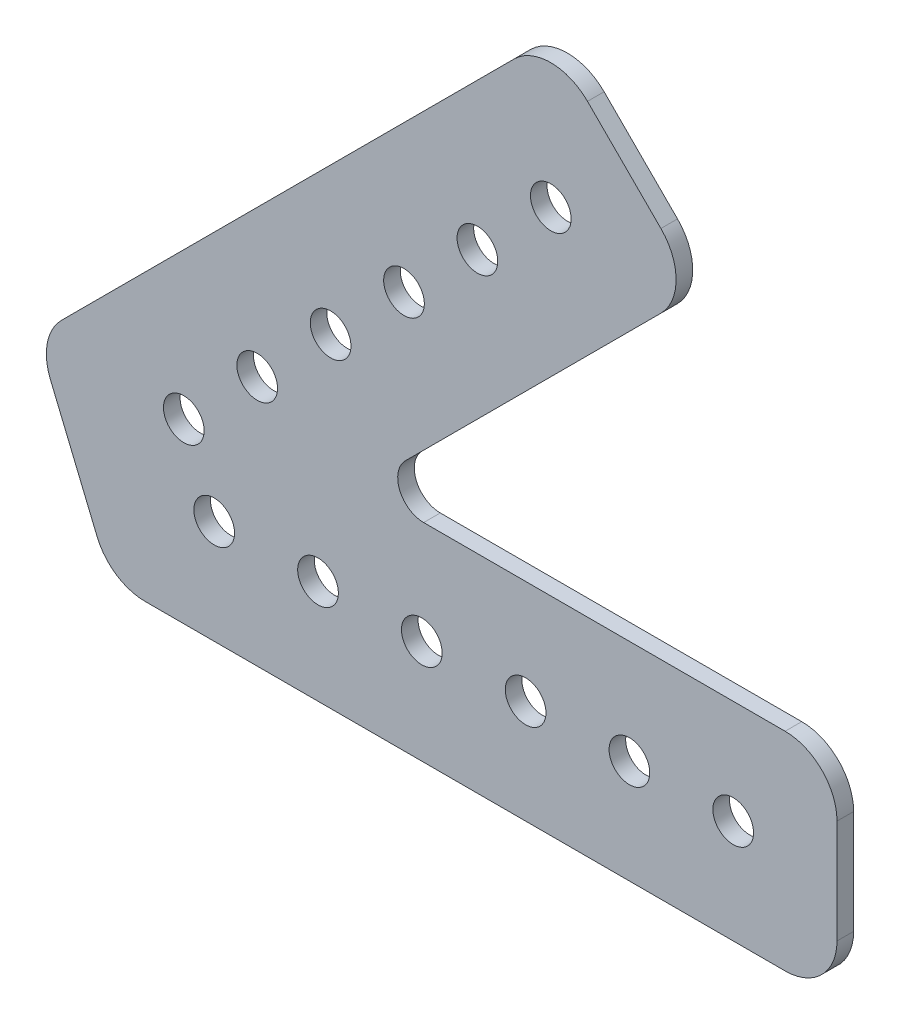
ISO-10303-21;
HEADER;
FILE_DESCRIPTION(('STEP AP214'),'2;1');
FILE_NAME('part.step','',(''),(''),'','','');
FILE_SCHEMA(('AUTOMOTIVE_DESIGN { 1 0 10303 214 1 1 1 1 }'));
ENDSEC;
DATA;
#1=APPLICATION_CONTEXT('core data for automotive mechanical design processes');
#2=APPLICATION_PROTOCOL_DEFINITION('international standard','automotive_design',2000,#1);
#3=PRODUCT_CONTEXT('',#1,'mechanical');
#4=PRODUCT('Part','Part','',(#3));
#5=PRODUCT_RELATED_PRODUCT_CATEGORY('part','',(#4));
#6=PRODUCT_DEFINITION_FORMATION('','',#4);
#7=PRODUCT_DEFINITION_CONTEXT('part definition',#1,'design');
#8=PRODUCT_DEFINITION('design','',#6,#7);
#9=PRODUCT_DEFINITION_SHAPE('','',#8);
#10=(LENGTH_UNIT() NAMED_UNIT(*) SI_UNIT(.MILLI.,.METRE.));
#11=(NAMED_UNIT(*) PLANE_ANGLE_UNIT() SI_UNIT($,.RADIAN.));
#12=(NAMED_UNIT(*) SI_UNIT($,.STERADIAN.) SOLID_ANGLE_UNIT());
#13=UNCERTAINTY_MEASURE_WITH_UNIT(LENGTH_MEASURE(1.E-05),#10,'distance_accuracy_value','');
#14=(GEOMETRIC_REPRESENTATION_CONTEXT(3) GLOBAL_UNCERTAINTY_ASSIGNED_CONTEXT((#13)) GLOBAL_UNIT_ASSIGNED_CONTEXT((#10,
#11,#12)) REPRESENTATION_CONTEXT('',''));
#15=CARTESIAN_POINT('',(0.,0.,0.));
#16=DIRECTION('',(0.,0.,1.));
#17=DIRECTION('',(1.,0.,0.));
#18=AXIS2_PLACEMENT_3D('',#15,#16,#17);
#19=CARTESIAN_POINT('',(-45.0430872745495,30.8661280546948,0.));
#20=DIRECTION('',(0.,0.,1.));
#21=DIRECTION('',(1.,0.,0.));
#22=AXIS2_PLACEMENT_3D('',#19,#20,#21);
#23=PLANE('',#22);
#24=CARTESIAN_POINT('',(-12.7,12.7,0.));
#25=DIRECTION('',(0.,0.,1.));
#26=DIRECTION('',(1.,0.,0.));
#27=AXIS2_PLACEMENT_3D('',#24,#25,#26);
#28=CIRCLE('',#27,2.4892);
#29=CARTESIAN_POINT('',(-10.2108,12.7,0.));
#30=VERTEX_POINT('',#29);
#31=EDGE_CURVE('E222',#30,#30,#28,.T.);
#32=ORIENTED_EDGE('',*,*,#31,.T.);
#33=EDGE_LOOP('',(#32));
#34=FACE_BOUND('',#33,.T.);
#35=CARTESIAN_POINT('',(-43.9987193946542,57.6012806053458,0.));
#36=DIRECTION('',(0.,0.,1.));
#37=DIRECTION('',(1.,0.,0.));
#38=AXIS2_PLACEMENT_3D('',#35,#36,#37);
#39=CIRCLE('',#38,2.4892);
#40=CARTESIAN_POINT('',(-41.5095193946542,57.6012806053458,0.));
#41=VERTEX_POINT('',#40);
#42=EDGE_CURVE('E225',#41,#41,#39,.T.);
#43=ORIENTED_EDGE('',*,*,#42,.T.);
#44=EDGE_LOOP('',(#43));
#45=FACE_BOUND('',#44,.T.);
#46=CARTESIAN_POINT('',(-61.9592316367926,39.6407683632074,0.));
#47=DIRECTION('',(0.,0.,1.));
#48=DIRECTION('',(1.,0.,0.));
#49=AXIS2_PLACEMENT_3D('',#46,#47,#48);
#50=CIRCLE('',#49,2.4892);
#51=CARTESIAN_POINT('',(-59.4700316367926,39.6407683632074,0.));
#52=VERTEX_POINT('',#51);
#53=EDGE_CURVE('E228',#52,#52,#50,.T.);
#54=ORIENTED_EDGE('',*,*,#53,.T.);
#55=EDGE_LOOP('',(#54));
#56=FACE_BOUND('',#55,.T.);
#57=CARTESIAN_POINT('',(-25.4,12.7,0.));
#58=DIRECTION('',(0.,0.,1.));
#59=DIRECTION('',(1.,0.,0.));
#60=AXIS2_PLACEMENT_3D('',#57,#58,#59);
#61=CIRCLE('',#60,2.4892);
#62=CARTESIAN_POINT('',(-22.9108,12.7,0.));
#63=VERTEX_POINT('',#62);
#64=EDGE_CURVE('E231',#63,#63,#61,.T.);
#65=ORIENTED_EDGE('',*,*,#64,.T.);
#66=EDGE_LOOP('',(#65));
#67=FACE_BOUND('',#66,.T.);
#68=CARTESIAN_POINT('',(-50.8,12.7,0.));
#69=DIRECTION('',(0.,0.,1.));
#70=DIRECTION('',(1.,0.,0.));
#71=AXIS2_PLACEMENT_3D('',#68,#69,#70);
#72=CIRCLE('',#71,2.4892);
#73=CARTESIAN_POINT('',(-48.3108,12.7,0.));
#74=VERTEX_POINT('',#73);
#75=EDGE_CURVE('E234',#74,#74,#72,.T.);
#76=ORIENTED_EDGE('',*,*,#75,.T.);
#77=EDGE_LOOP('',(#76));
#78=FACE_BOUND('',#77,.T.);
#79=CARTESIAN_POINT('',(-79.9197438789309,21.6802561210692,0.));
#80=DIRECTION('',(0.,0.,1.));
#81=DIRECTION('',(1.,0.,0.));
#82=AXIS2_PLACEMENT_3D('',#79,#80,#81);
#83=CIRCLE('',#82,2.4892);
#84=CARTESIAN_POINT('',(-77.4305438789309,21.6802561210692,0.));
#85=VERTEX_POINT('',#84);
#86=EDGE_CURVE('E237',#85,#85,#83,.T.);
#87=ORIENTED_EDGE('',*,*,#86,.T.);
#88=EDGE_LOOP('',(#87));
#89=FACE_BOUND('',#88,.T.);
#90=CARTESIAN_POINT('',(-76.2,12.7,0.));
#91=DIRECTION('',(0.,0.,1.));
#92=DIRECTION('',(1.,0.,0.));
#93=AXIS2_PLACEMENT_3D('',#90,#91,#92);
#94=CIRCLE('',#93,2.4892);
#95=CARTESIAN_POINT('',(-73.7108,12.7,0.));
#96=VERTEX_POINT('',#95);
#97=EDGE_CURVE('E240',#96,#96,#94,.T.);
#98=ORIENTED_EDGE('',*,*,#97,.T.);
#99=EDGE_LOOP('',(#98));
#100=FACE_BOUND('',#99,.T.);
#101=CARTESIAN_POINT('',(-63.5,12.7,0.));
#102=DIRECTION('',(0.,0.,1.));
#103=DIRECTION('',(1.,0.,0.));
#104=AXIS2_PLACEMENT_3D('',#101,#102,#103);
#105=CIRCLE('',#104,2.4892);
#106=CARTESIAN_POINT('',(-61.0108,12.7,0.));
#107=VERTEX_POINT('',#106);
#108=EDGE_CURVE('E243',#107,#107,#105,.T.);
#109=ORIENTED_EDGE('',*,*,#108,.T.);
#110=EDGE_LOOP('',(#109));
#111=FACE_BOUND('',#110,.T.);
#112=CARTESIAN_POINT('',(-38.1,12.7,0.));
#113=DIRECTION('',(0.,0.,1.));
#114=DIRECTION('',(1.,0.,0.));
#115=AXIS2_PLACEMENT_3D('',#112,#113,#114);
#116=CIRCLE('',#115,2.4892);
#117=CARTESIAN_POINT('',(-35.6108,12.7,0.));
#118=VERTEX_POINT('',#117);
#119=EDGE_CURVE('E246',#118,#118,#116,.T.);
#120=ORIENTED_EDGE('',*,*,#119,.T.);
#121=EDGE_LOOP('',(#120));
#122=FACE_BOUND('',#121,.T.);
#123=CARTESIAN_POINT('',(-70.9394877578616,30.6605122421384,0.));
#124=DIRECTION('',(0.,0.,1.));
#125=DIRECTION('',(1.,0.,0.));
#126=AXIS2_PLACEMENT_3D('',#123,#124,#125);
#127=CIRCLE('',#126,2.4892);
#128=CARTESIAN_POINT('',(-68.4502877578616,30.6605122421384,0.));
#129=VERTEX_POINT('',#128);
#130=EDGE_CURVE('E249',#129,#129,#127,.T.);
#131=ORIENTED_EDGE('',*,*,#130,.T.);
#132=EDGE_LOOP('',(#131));
#133=FACE_BOUND('',#132,.T.);
#134=CARTESIAN_POINT('',(-52.9789755157235,48.6210244842765,0.));
#135=DIRECTION('',(0.,0.,1.));
#136=DIRECTION('',(1.,0.,0.));
#137=AXIS2_PLACEMENT_3D('',#134,#135,#136);
#138=CIRCLE('',#137,2.4892);
#139=CARTESIAN_POINT('',(-50.4897755157235,48.6210244842765,0.));
#140=VERTEX_POINT('',#139);
#141=EDGE_CURVE('E136',#140,#140,#138,.T.);
#142=ORIENTED_EDGE('',*,*,#141,.T.);
#143=EDGE_LOOP('',(#142));
#144=FACE_BOUND('',#143,.T.);
#145=CARTESIAN_POINT('',(-35.0184632735851,66.5815367264149,0.));
#146=DIRECTION('',(0.,0.,1.));
#147=DIRECTION('',(1.,0.,0.));
#148=AXIS2_PLACEMENT_3D('',#145,#146,#147);
#149=CIRCLE('',#148,2.4892);
#150=CARTESIAN_POINT('',(-32.5292632735852,66.5815367264149,0.));
#151=VERTEX_POINT('',#150);
#152=EDGE_CURVE('E133',#151,#151,#149,.T.);
#153=ORIENTED_EDGE('',*,*,#152,.T.);
#154=EDGE_LOOP('',(#153));
#155=FACE_BOUND('',#154,.T.);
#156=DIRECTION('',(-0.707106781186548,-0.707106781186547,0.));
#157=VECTOR('',#156,1.);
#158=CARTESIAN_POINT('',(-35.0184632735851,84.5420489685532,0.));
#159=LINE('',#158,#157);
#160=CARTESIAN_POINT('',(-39.5085913341197,80.0519209080187,0.));
#161=VERTEX_POINT('',#160);
#162=CARTESIAN_POINT('',(-94.880048469498,24.6804637726404,0.));
#163=VERTEX_POINT('',#162);
#164=EDGE_CURVE('E117',#161,#163,#159,.T.);
#165=ORIENTED_EDGE('',*,*,#164,.F.);
#166=CARTESIAN_POINT('',(-35.0184632735851,75.5617928474842,0.));
#167=DIRECTION('',(0.,0.,1.));
#168=DIRECTION('',(1.,0.,0.));
#169=AXIS2_PLACEMENT_3D('',#166,#167,#168);
#170=CIRCLE('',#169,6.35);
#171=CARTESIAN_POINT('',(-30.5283352130505,80.0519209080187,0.));
#172=VERTEX_POINT('',#171);
#173=EDGE_CURVE('E130',#172,#161,#170,.T.);
#174=ORIENTED_EDGE('',*,*,#173,.F.);
#175=DIRECTION('',(-0.707106781186548,0.707106781186547,0.));
#176=VECTOR('',#175,1.);
#177=CARTESIAN_POINT('',(-17.0579510314468,66.5815367264149,0.));
#178=LINE('',#177,#176);
#179=CARTESIAN_POINT('',(-21.5480790919813,71.0716647869494,0.));
#180=VERTEX_POINT('',#179);
#181=EDGE_CURVE('E142',#180,#172,#178,.T.);
#182=ORIENTED_EDGE('',*,*,#181,.F.);
#183=CARTESIAN_POINT('',(-26.0382071525158,66.5815367264149,0.));
#184=DIRECTION('',(0.,0.,1.));
#185=DIRECTION('',(1.,0.,0.));
#186=AXIS2_PLACEMENT_3D('',#183,#184,#185);
#187=CIRCLE('',#186,6.35);
#188=CARTESIAN_POINT('',(-21.5480790919813,62.0914086658803,0.));
#189=VERTEX_POINT('',#188);
#190=EDGE_CURVE('E255',#189,#180,#187,.T.);
#191=ORIENTED_EDGE('',*,*,#190,.F.);
#192=DIRECTION('',(0.707106781186547,0.707106781186548,0.));
#193=VECTOR('',#192,1.);
#194=CARTESIAN_POINT('',(-58.2394877578616,25.4,0.));
#195=LINE('',#194,#193);
#196=CARTESIAN_POINT('',(-52.8194237275944,30.8200640302673,0.));
#197=VERTEX_POINT('',#196);
#198=EDGE_CURVE('E146',#197,#189,#195,.T.);
#199=ORIENTED_EDGE('',*,*,#198,.F.);
#200=CARTESIAN_POINT('',(-50.5743596973272,28.575,0.));
#201=DIRECTION('',(0.,0.,1.));
#202=DIRECTION('',(1.,0.,0.));
#203=AXIS2_PLACEMENT_3D('',#200,#201,#202);
#204=CIRCLE('',#203,3.175);
#205=CARTESIAN_POINT('',(-50.5743596973272,25.4,0.));
#206=VERTEX_POINT('',#205);
#207=EDGE_CURVE('E257',#197,#206,#204,.T.);
#208=ORIENTED_EDGE('',*,*,#207,.T.);
#209=DIRECTION('',(1.,0.,0.));
#210=VECTOR('',#209,1.);
#211=CARTESIAN_POINT('',(0.,25.4,0.));
#212=LINE('',#211,#210);
#213=CARTESIAN_POINT('',(-6.35,25.4,0.));
#214=VERTEX_POINT('',#213);
#215=EDGE_CURVE('E150',#214,#206,#212,.F.);
#216=ORIENTED_EDGE('',*,*,#215,.F.);
#217=CARTESIAN_POINT('',(-6.35,19.05,0.));
#218=DIRECTION('',(0.,0.,1.));
#219=DIRECTION('',(1.,0.,0.));
#220=AXIS2_PLACEMENT_3D('',#217,#218,#219);
#221=CIRCLE('',#220,6.35);
#222=CARTESIAN_POINT('',(0.,19.05,0.));
#223=VERTEX_POINT('',#222);
#224=EDGE_CURVE('E260',#223,#214,#221,.T.);
#225=ORIENTED_EDGE('',*,*,#224,.F.);
#226=DIRECTION('',(0.,1.,0.));
#227=VECTOR('',#226,1.);
#228=CARTESIAN_POINT('',(0.,0.,0.));
#229=LINE('',#228,#227);
#230=CARTESIAN_POINT('',(0.,6.35,0.));
#231=VERTEX_POINT('',#230);
#232=EDGE_CURVE('E154',#231,#223,#229,.T.);
#233=ORIENTED_EDGE('',*,*,#232,.F.);
#234=CARTESIAN_POINT('',(-6.35,6.35,0.));
#235=DIRECTION('',(0.,0.,1.));
#236=DIRECTION('',(1.,0.,0.));
#237=AXIS2_PLACEMENT_3D('',#234,#235,#236);
#238=CIRCLE('',#237,6.35);
#239=CARTESIAN_POINT('',(-6.35,0.,0.));
#240=VERTEX_POINT('',#239);
#241=EDGE_CURVE('E262',#240,#231,#238,.T.);
#242=ORIENTED_EDGE('',*,*,#241,.F.);
#243=DIRECTION('',(1.,0.,0.));
#244=VECTOR('',#243,1.);
#245=CARTESIAN_POINT('',(-88.9,0.,0.));
#246=LINE('',#245,#244);
#247=CARTESIAN_POINT('',(-84.6570656492126,0.,0.));
#248=VERTEX_POINT('',#247);
#249=EDGE_CURVE('E158',#248,#240,#246,.T.);
#250=ORIENTED_EDGE('',*,*,#249,.F.);
#251=CARTESIAN_POINT('',(-84.6570656492126,6.35,0.));
#252=DIRECTION('',(0.,0.,1.));
#253=DIRECTION('',(1.,0.,0.));
#254=AXIS2_PLACEMENT_3D('',#251,#252,#253);
#255=CIRCLE('',#254,6.35);
#256=CARTESIAN_POINT('',(-90.5237006806591,3.91996020448172,0.));
#257=VERTEX_POINT('',#256);
#258=EDGE_CURVE('E263',#257,#248,#255,.T.);
#259=ORIENTED_EDGE('',*,*,#258,.F.);
#260=DIRECTION('',(0.38268343236509,-0.923879532511287,0.));
#261=VECTOR('',#260,1.);
#262=CARTESIAN_POINT('',(-97.8802561210691,21.6802561210692,0.));
#263=LINE('',#262,#261);
#264=CARTESIAN_POINT('',(-96.25655544041,17.7602959165875,0.));
#265=VERTEX_POINT('',#264);
#266=EDGE_CURVE('E119',#265,#257,#263,.T.);
#267=ORIENTED_EDGE('',*,*,#266,.F.);
#268=CARTESIAN_POINT('',(-90.3899204089635,20.1903357121058,0.));
#269=DIRECTION('',(0.,0.,1.));
#270=DIRECTION('',(1.,0.,0.));
#271=AXIS2_PLACEMENT_3D('',#268,#269,#270);
#272=CIRCLE('',#271,6.35);
#273=EDGE_CURVE('E18',#163,#265,#272,.T.);
#274=ORIENTED_EDGE('',*,*,#273,.F.);
#275=EDGE_LOOP('',(#165,#174,#182,#191,#199,#208,#216,#225,#233,#242,#250,#259,#267,#274));
#276=FACE_BOUND('',#275,.T.);
#277=ADVANCED_FACE('F15',(#34,#45,#56,#67,#78,#89,#100,#111,#122,#133,#144,#155,#276),#23,.F.);
#278=CARTESIAN_POINT('',(-90.3899204089635,20.1903357121058,0.));
#279=DIRECTION('',(0.,0.,1.));
#280=DIRECTION('',(1.,0.,0.));
#281=AXIS2_PLACEMENT_3D('',#278,#279,#280);
#282=CYLINDRICAL_SURFACE('',#281,6.35);
#283=ORIENTED_EDGE('',*,*,#273,.T.);
#284=DIRECTION('',(0.,0.,1.));
#285=VECTOR('',#284,1.);
#286=CARTESIAN_POINT('',(-96.25655544041,17.7602959165875,0.));
#287=LINE('',#286,#285);
#288=CARTESIAN_POINT('',(-96.25655544041,17.7602959165875,2.032));
#289=VERTEX_POINT('',#288);
#290=EDGE_CURVE('E122',#289,#265,#287,.F.);
#291=ORIENTED_EDGE('',*,*,#290,.F.);
#292=CARTESIAN_POINT('',(-90.3899204089635,20.1903357121058,2.032));
#293=DIRECTION('',(0.,0.,1.));
#294=DIRECTION('',(1.,0.,0.));
#295=AXIS2_PLACEMENT_3D('',#292,#293,#294);
#296=CIRCLE('',#295,6.35);
#297=CARTESIAN_POINT('',(-94.880048469498,24.6804637726404,2.032));
#298=VERTEX_POINT('',#297);
#299=EDGE_CURVE('E127',#298,#289,#296,.T.);
#300=ORIENTED_EDGE('',*,*,#299,.F.);
#301=DIRECTION('',(0.,0.,1.));
#302=VECTOR('',#301,1.);
#303=CARTESIAN_POINT('',(-94.8800484694979,24.6804637726404,0.));
#304=LINE('',#303,#302);
#305=EDGE_CURVE('E124',#163,#298,#304,.T.);
#306=ORIENTED_EDGE('',*,*,#305,.F.);
#307=EDGE_LOOP('',(#283,#291,#300,#306));
#308=FACE_BOUND('',#307,.T.);
#309=ADVANCED_FACE('F125',(#308),#282,.T.);
#310=CARTESIAN_POINT('',(-97.8802561210691,21.6802561210692,0.));
#311=DIRECTION('',(-0.923879532511287,-0.38268343236509,0.));
#312=DIRECTION('',(0.38268343236509,-0.923879532511287,0.));
#313=AXIS2_PLACEMENT_3D('',#310,#311,#312);
#314=PLANE('',#313);
#315=DIRECTION('',(0.,0.,1.));
#316=VECTOR('',#315,1.);
#317=CARTESIAN_POINT('',(-90.5237006806592,3.91996020448168,0.));
#318=LINE('',#317,#316);
#319=CARTESIAN_POINT('',(-90.5237006806592,3.91996020448169,2.032));
#320=VERTEX_POINT('',#319);
#321=EDGE_CURVE('E162',#320,#257,#318,.F.);
#322=ORIENTED_EDGE('',*,*,#321,.F.);
#323=DIRECTION('',(0.38268343236509,-0.923879532511287,0.));
#324=VECTOR('',#323,1.);
#325=CARTESIAN_POINT('',(-96.2565554404101,17.7602959165875,2.032));
#326=LINE('',#325,#324);
#327=EDGE_CURVE('E220',#289,#320,#326,.T.);
#328=ORIENTED_EDGE('',*,*,#327,.F.);
#329=ORIENTED_EDGE('',*,*,#290,.T.);
#330=ORIENTED_EDGE('',*,*,#266,.T.);
#331=EDGE_LOOP('',(#322,#328,#329,#330));
#332=FACE_BOUND('',#331,.T.);
#333=ADVANCED_FACE('F341',(#332),#314,.T.);
#334=CARTESIAN_POINT('',(-84.6570656492126,6.35,0.));
#335=DIRECTION('',(0.,0.,1.));
#336=DIRECTION('',(1.,0.,0.));
#337=AXIS2_PLACEMENT_3D('',#334,#335,#336);
#338=CYLINDRICAL_SURFACE('',#337,6.35);
#339=ORIENTED_EDGE('',*,*,#258,.T.);
#340=DIRECTION('',(0.,0.,-1.));
#341=VECTOR('',#340,1.);
#342=CARTESIAN_POINT('',(-84.6570656492126,0.,0.));
#343=LINE('',#342,#341);
#344=CARTESIAN_POINT('',(-84.6570656492126,0.,2.032));
#345=VERTEX_POINT('',#344);
#346=EDGE_CURVE('E161',#345,#248,#343,.T.);
#347=ORIENTED_EDGE('',*,*,#346,.F.);
#348=CARTESIAN_POINT('',(-84.6570656492126,6.35,2.032));
#349=DIRECTION('',(0.,0.,1.));
#350=DIRECTION('',(1.,0.,0.));
#351=AXIS2_PLACEMENT_3D('',#348,#349,#350);
#352=CIRCLE('',#351,6.35);
#353=EDGE_CURVE('E217',#320,#345,#352,.T.);
#354=ORIENTED_EDGE('',*,*,#353,.F.);
#355=ORIENTED_EDGE('',*,*,#321,.T.);
#356=EDGE_LOOP('',(#339,#347,#354,#355));
#357=FACE_BOUND('',#356,.T.);
#358=ADVANCED_FACE('F338',(#357),#338,.T.);
#359=CARTESIAN_POINT('',(-88.9,0.,0.));
#360=DIRECTION('',(0.,-1.,0.));
#361=DIRECTION('',(0.,0.,-1.));
#362=AXIS2_PLACEMENT_3D('',#359,#360,#361);
#363=PLANE('',#362);
#364=DIRECTION('',(0.,0.,1.));
#365=VECTOR('',#364,1.);
#366=CARTESIAN_POINT('',(-6.35,0.,0.));
#367=LINE('',#366,#365);
#368=CARTESIAN_POINT('',(-6.35,0.,2.032));
#369=VERTEX_POINT('',#368);
#370=EDGE_CURVE('E160',#369,#240,#367,.F.);
#371=ORIENTED_EDGE('',*,*,#370,.F.);
#372=DIRECTION('',(1.,0.,0.));
#373=VECTOR('',#372,1.);
#374=CARTESIAN_POINT('',(-45.0430872745495,0.,2.032));
#375=LINE('',#374,#373);
#376=EDGE_CURVE('E216',#345,#369,#375,.T.);
#377=ORIENTED_EDGE('',*,*,#376,.F.);
#378=ORIENTED_EDGE('',*,*,#346,.T.);
#379=ORIENTED_EDGE('',*,*,#249,.T.);
#380=EDGE_LOOP('',(#371,#377,#378,#379));
#381=FACE_BOUND('',#380,.T.);
#382=ADVANCED_FACE('F337',(#381),#363,.T.);
#383=CARTESIAN_POINT('',(-6.35,6.35,0.));
#384=DIRECTION('',(0.,0.,1.));
#385=DIRECTION('',(1.,0.,0.));
#386=AXIS2_PLACEMENT_3D('',#383,#384,#385);
#387=CYLINDRICAL_SURFACE('',#386,6.35);
#388=ORIENTED_EDGE('',*,*,#241,.T.);
#389=DIRECTION('',(0.,0.,1.));
#390=VECTOR('',#389,1.);
#391=CARTESIAN_POINT('',(0.,6.35,0.));
#392=LINE('',#391,#390);
#393=CARTESIAN_POINT('',(0.,6.35,2.032));
#394=VERTEX_POINT('',#393);
#395=EDGE_CURVE('E157',#394,#231,#392,.F.);
#396=ORIENTED_EDGE('',*,*,#395,.F.);
#397=CARTESIAN_POINT('',(-6.35,6.35,2.032));
#398=DIRECTION('',(0.,0.,1.));
#399=DIRECTION('',(1.,0.,0.));
#400=AXIS2_PLACEMENT_3D('',#397,#398,#399);
#401=CIRCLE('',#400,6.35);
#402=EDGE_CURVE('E213',#369,#394,#401,.T.);
#403=ORIENTED_EDGE('',*,*,#402,.F.);
#404=ORIENTED_EDGE('',*,*,#370,.T.);
#405=EDGE_LOOP('',(#388,#396,#403,#404));
#406=FACE_BOUND('',#405,.T.);
#407=ADVANCED_FACE('F334',(#406),#387,.T.);
#408=CARTESIAN_POINT('',(0.,0.,0.));
#409=DIRECTION('',(1.,0.,0.));
#410=DIRECTION('',(0.,1.,0.));
#411=AXIS2_PLACEMENT_3D('',#408,#409,#410);
#412=PLANE('',#411);
#413=DIRECTION('',(0.,0.,1.));
#414=VECTOR('',#413,1.);
#415=CARTESIAN_POINT('',(0.,19.05,0.));
#416=LINE('',#415,#414);
#417=CARTESIAN_POINT('',(0.,19.05,2.032));
#418=VERTEX_POINT('',#417);
#419=EDGE_CURVE('E156',#418,#223,#416,.F.);
#420=ORIENTED_EDGE('',*,*,#419,.F.);
#421=DIRECTION('',(0.,1.,0.));
#422=VECTOR('',#421,1.);
#423=CARTESIAN_POINT('',(0.,30.8661280546948,2.032));
#424=LINE('',#423,#422);
#425=EDGE_CURVE('E212',#394,#418,#424,.T.);
#426=ORIENTED_EDGE('',*,*,#425,.F.);
#427=ORIENTED_EDGE('',*,*,#395,.T.);
#428=ORIENTED_EDGE('',*,*,#232,.T.);
#429=EDGE_LOOP('',(#420,#426,#427,#428));
#430=FACE_BOUND('',#429,.T.);
#431=ADVANCED_FACE('F330',(#430),#412,.T.);
#432=CARTESIAN_POINT('',(-6.35,19.05,0.));
#433=DIRECTION('',(0.,0.,1.));
#434=DIRECTION('',(1.,0.,0.));
#435=AXIS2_PLACEMENT_3D('',#432,#433,#434);
#436=CYLINDRICAL_SURFACE('',#435,6.35);
#437=ORIENTED_EDGE('',*,*,#224,.T.);
#438=DIRECTION('',(0.,0.,1.));
#439=VECTOR('',#438,1.);
#440=CARTESIAN_POINT('',(-6.35,25.4,0.));
#441=LINE('',#440,#439);
#442=CARTESIAN_POINT('',(-6.35,25.4,2.032));
#443=VERTEX_POINT('',#442);
#444=EDGE_CURVE('E153',#443,#214,#441,.F.);
#445=ORIENTED_EDGE('',*,*,#444,.F.);
#446=CARTESIAN_POINT('',(-6.35,19.05,2.032));
#447=DIRECTION('',(0.,0.,1.));
#448=DIRECTION('',(1.,0.,0.));
#449=AXIS2_PLACEMENT_3D('',#446,#447,#448);
#450=CIRCLE('',#449,6.35);
#451=EDGE_CURVE('E209',#418,#443,#450,.T.);
#452=ORIENTED_EDGE('',*,*,#451,.F.);
#453=ORIENTED_EDGE('',*,*,#419,.T.);
#454=EDGE_LOOP('',(#437,#445,#452,#453));
#455=FACE_BOUND('',#454,.T.);
#456=ADVANCED_FACE('F327',(#455),#436,.T.);
#457=CARTESIAN_POINT('',(0.,25.4,0.));
#458=DIRECTION('',(0.,1.,0.));
#459=DIRECTION('',(0.,0.,1.));
#460=AXIS2_PLACEMENT_3D('',#457,#458,#459);
#461=PLANE('',#460);
#462=ORIENTED_EDGE('',*,*,#444,.T.);
#463=ORIENTED_EDGE('',*,*,#215,.T.);
#464=DIRECTION('',(0.,0.,1.));
#465=VECTOR('',#464,1.);
#466=CARTESIAN_POINT('',(-50.5743596973272,25.4,0.));
#467=LINE('',#466,#465);
#468=CARTESIAN_POINT('',(-50.5743596973272,25.4,2.032));
#469=VERTEX_POINT('',#468);
#470=EDGE_CURVE('E152',#206,#469,#467,.T.);
#471=ORIENTED_EDGE('',*,*,#470,.T.);
#472=DIRECTION('',(1.,0.,0.));
#473=VECTOR('',#472,1.);
#474=CARTESIAN_POINT('',(-45.0430872745495,25.4,2.032));
#475=LINE('',#474,#473);
#476=EDGE_CURVE('E208',#443,#469,#475,.F.);
#477=ORIENTED_EDGE('',*,*,#476,.F.);
#478=EDGE_LOOP('',(#462,#463,#471,#477));
#479=FACE_BOUND('',#478,.T.);
#480=ADVANCED_FACE('F324',(#479),#461,.T.);
#481=CARTESIAN_POINT('',(-50.5743596973272,28.575,0.));
#482=DIRECTION('',(0.,0.,1.));
#483=DIRECTION('',(1.,0.,0.));
#484=AXIS2_PLACEMENT_3D('',#481,#482,#483);
#485=CYLINDRICAL_SURFACE('',#484,3.175);
#486=DIRECTION('',(0.,0.,1.));
#487=VECTOR('',#486,1.);
#488=CARTESIAN_POINT('',(-52.8194237275943,30.8200640302673,0.));
#489=LINE('',#488,#487);
#490=CARTESIAN_POINT('',(-52.8194237275944,30.8200640302673,2.032));
#491=VERTEX_POINT('',#490);
#492=EDGE_CURVE('E149',#491,#197,#489,.F.);
#493=ORIENTED_EDGE('',*,*,#492,.F.);
#494=CARTESIAN_POINT('',(-50.5743596973272,28.575,2.032));
#495=DIRECTION('',(0.,0.,1.));
#496=DIRECTION('',(1.,0.,0.));
#497=AXIS2_PLACEMENT_3D('',#494,#495,#496);
#498=CIRCLE('',#497,3.175);
#499=EDGE_CURVE('E205',#469,#491,#498,.F.);
#500=ORIENTED_EDGE('',*,*,#499,.F.);
#501=ORIENTED_EDGE('',*,*,#470,.F.);
#502=ORIENTED_EDGE('',*,*,#207,.F.);
#503=EDGE_LOOP('',(#493,#500,#501,#502));
#504=FACE_BOUND('',#503,.T.);
#505=ADVANCED_FACE('F317',(#504),#485,.F.);
#506=CARTESIAN_POINT('',(-58.2394877578616,25.4,0.));
#507=DIRECTION('',(0.707106781186548,-0.707106781186547,0.));
#508=DIRECTION('',(0.707106781186547,0.707106781186548,0.));
#509=AXIS2_PLACEMENT_3D('',#506,#507,#508);
#510=PLANE('',#509);
#511=DIRECTION('',(0.,0.,1.));
#512=VECTOR('',#511,1.);
#513=CARTESIAN_POINT('',(-21.5480790919812,62.0914086658803,0.));
#514=LINE('',#513,#512);
#515=CARTESIAN_POINT('',(-21.5480790919813,62.0914086658804,2.032));
#516=VERTEX_POINT('',#515);
#517=EDGE_CURVE('E148',#516,#189,#514,.F.);
#518=ORIENTED_EDGE('',*,*,#517,.F.);
#519=DIRECTION('',(0.707106781186546,0.70710678118655,0.));
#520=VECTOR('',#519,1.);
#521=CARTESIAN_POINT('',(-52.8194237275943,30.8200640302673,2.032));
#522=LINE('',#521,#520);
#523=EDGE_CURVE('E204',#491,#516,#522,.T.);
#524=ORIENTED_EDGE('',*,*,#523,.F.);
#525=ORIENTED_EDGE('',*,*,#492,.T.);
#526=ORIENTED_EDGE('',*,*,#198,.T.);
#527=EDGE_LOOP('',(#518,#524,#525,#526));
#528=FACE_BOUND('',#527,.T.);
#529=ADVANCED_FACE('F314',(#528),#510,.T.);
#530=CARTESIAN_POINT('',(-26.0382071525158,66.5815367264149,0.));
#531=DIRECTION('',(0.,0.,1.));
#532=DIRECTION('',(1.,0.,0.));
#533=AXIS2_PLACEMENT_3D('',#530,#531,#532);
#534=CYLINDRICAL_SURFACE('',#533,6.35);
#535=ORIENTED_EDGE('',*,*,#190,.T.);
#536=DIRECTION('',(0.,0.,1.));
#537=VECTOR('',#536,1.);
#538=CARTESIAN_POINT('',(-21.5480790919814,71.0716647869495,0.));
#539=LINE('',#538,#537);
#540=CARTESIAN_POINT('',(-21.5480790919813,71.0716647869495,2.032));
#541=VERTEX_POINT('',#540);
#542=EDGE_CURVE('E145',#541,#180,#539,.F.);
#543=ORIENTED_EDGE('',*,*,#542,.F.);
#544=CARTESIAN_POINT('',(-26.0382071525158,66.5815367264149,2.032));
#545=DIRECTION('',(0.,0.,1.));
#546=DIRECTION('',(1.,0.,0.));
#547=AXIS2_PLACEMENT_3D('',#544,#545,#546);
#548=CIRCLE('',#547,6.35);
#549=EDGE_CURVE('E201',#516,#541,#548,.T.);
#550=ORIENTED_EDGE('',*,*,#549,.F.);
#551=ORIENTED_EDGE('',*,*,#517,.T.);
#552=EDGE_LOOP('',(#535,#543,#550,#551));
#553=FACE_BOUND('',#552,.T.);
#554=ADVANCED_FACE('F311',(#553),#534,.T.);
#555=CARTESIAN_POINT('',(-17.0579510314468,66.5815367264149,0.));
#556=DIRECTION('',(0.707106781186547,0.707106781186548,0.));
#557=DIRECTION('',(-0.707106781186548,0.707106781186547,0.));
#558=AXIS2_PLACEMENT_3D('',#555,#556,#557);
#559=PLANE('',#558);
#560=DIRECTION('',(0.,0.,1.));
#561=VECTOR('',#560,1.);
#562=CARTESIAN_POINT('',(-30.5283352130504,80.0519209080186,0.));
#563=LINE('',#562,#561);
#564=CARTESIAN_POINT('',(-30.5283352130505,80.0519209080187,2.032));
#565=VERTEX_POINT('',#564);
#566=EDGE_CURVE('E144',#565,#172,#563,.F.);
#567=ORIENTED_EDGE('',*,*,#566,.F.);
#568=DIRECTION('',(-0.70710678118655,0.707106781186545,0.));
#569=VECTOR('',#568,1.);
#570=CARTESIAN_POINT('',(-21.5480790919814,71.0716647869495,2.032));
#571=LINE('',#570,#569);
#572=EDGE_CURVE('E200',#541,#565,#571,.T.);
#573=ORIENTED_EDGE('',*,*,#572,.F.);
#574=ORIENTED_EDGE('',*,*,#542,.T.);
#575=ORIENTED_EDGE('',*,*,#181,.T.);
#576=EDGE_LOOP('',(#567,#573,#574,#575));
#577=FACE_BOUND('',#576,.T.);
#578=ADVANCED_FACE('F305',(#577),#559,.T.);
#579=CARTESIAN_POINT('',(-35.0184632735851,75.5617928474842,0.));
#580=DIRECTION('',(0.,0.,1.));
#581=DIRECTION('',(1.,0.,0.));
#582=AXIS2_PLACEMENT_3D('',#579,#580,#581);
#583=CYLINDRICAL_SURFACE('',#582,6.35);
#584=ORIENTED_EDGE('',*,*,#173,.T.);
#585=DIRECTION('',(0.,0.,1.));
#586=VECTOR('',#585,1.);
#587=CARTESIAN_POINT('',(-39.5085913341197,80.0519209080187,0.));
#588=LINE('',#587,#586);
#589=CARTESIAN_POINT('',(-39.5085913341196,80.0519209080186,2.032));
#590=VERTEX_POINT('',#589);
#591=EDGE_CURVE('E33',#590,#161,#588,.F.);
#592=ORIENTED_EDGE('',*,*,#591,.F.);
#593=CARTESIAN_POINT('',(-35.0184632735851,75.5617928474842,2.032));
#594=DIRECTION('',(0.,0.,1.));
#595=DIRECTION('',(1.,0.,0.));
#596=AXIS2_PLACEMENT_3D('',#593,#594,#595);
#597=CIRCLE('',#596,6.35);
#598=EDGE_CURVE('E197',#565,#590,#597,.T.);
#599=ORIENTED_EDGE('',*,*,#598,.F.);
#600=ORIENTED_EDGE('',*,*,#566,.T.);
#601=EDGE_LOOP('',(#584,#592,#599,#600));
#602=FACE_BOUND('',#601,.T.);
#603=ADVANCED_FACE('F303',(#602),#583,.T.);
#604=CARTESIAN_POINT('',(-35.0184632735851,84.5420489685532,0.));
#605=DIRECTION('',(-0.707106781186547,0.707106781186548,0.));
#606=DIRECTION('',(-0.707106781186548,-0.707106781186547,0.));
#607=AXIS2_PLACEMENT_3D('',#604,#605,#606);
#608=PLANE('',#607);
#609=ORIENTED_EDGE('',*,*,#591,.T.);
#610=ORIENTED_EDGE('',*,*,#164,.T.);
#611=ORIENTED_EDGE('',*,*,#305,.T.);
#612=DIRECTION('',(-0.707106781186548,-0.707106781186547,0.));
#613=VECTOR('',#612,1.);
#614=CARTESIAN_POINT('',(-39.5085913341195,80.0519209080186,2.032));
#615=LINE('',#614,#613);
#616=EDGE_CURVE('E196',#590,#298,#615,.T.);
#617=ORIENTED_EDGE('',*,*,#616,.F.);
#618=EDGE_LOOP('',(#609,#610,#611,#617));
#619=FACE_BOUND('',#618,.T.);
#620=ADVANCED_FACE('F132',(#619),#608,.T.);
#621=CARTESIAN_POINT('',(-35.0184632735851,66.5815367264149,129.352354466888));
#622=DIRECTION('',(0.,0.,1.));
#623=DIRECTION('',(1.,0.,0.));
#624=AXIS2_PLACEMENT_3D('',#621,#622,#623);
#625=CYLINDRICAL_SURFACE('',#624,2.4892);
#626=ORIENTED_EDGE('',*,*,#152,.F.);
#627=EDGE_LOOP('',(#626));
#628=FACE_BOUND('',#627,.T.);
#629=CARTESIAN_POINT('',(-35.0184632735851,66.5815367264149,2.03200000000001));
#630=DIRECTION('',(0.,0.,1.));
#631=DIRECTION('',(1.,0.,0.));
#632=AXIS2_PLACEMENT_3D('',#629,#630,#631);
#633=CIRCLE('',#632,2.4892);
#634=CARTESIAN_POINT('',(-32.5292632735852,66.5815367264149,2.03200000000001));
#635=VERTEX_POINT('',#634);
#636=EDGE_CURVE('E193',#635,#635,#633,.F.);
#637=ORIENTED_EDGE('',*,*,#636,.F.);
#638=EDGE_LOOP('',(#637));
#639=FACE_BOUND('',#638,.T.);
#640=ADVANCED_FACE('F400',(#628,#639),#625,.F.);
#641=CARTESIAN_POINT('',(-52.9789755157235,48.6210244842765,129.352354466888));
#642=DIRECTION('',(0.,0.,1.));
#643=DIRECTION('',(1.,0.,0.));
#644=AXIS2_PLACEMENT_3D('',#641,#642,#643);
#645=CYLINDRICAL_SURFACE('',#644,2.4892);
#646=ORIENTED_EDGE('',*,*,#141,.F.);
#647=EDGE_LOOP('',(#646));
#648=FACE_BOUND('',#647,.T.);
#649=CARTESIAN_POINT('',(-52.9789755157235,48.6210244842765,2.03200000000001));
#650=DIRECTION('',(0.,0.,1.));
#651=DIRECTION('',(1.,0.,0.));
#652=AXIS2_PLACEMENT_3D('',#649,#650,#651);
#653=CIRCLE('',#652,2.4892);
#654=CARTESIAN_POINT('',(-50.4897755157235,48.6210244842765,2.03200000000001));
#655=VERTEX_POINT('',#654);
#656=EDGE_CURVE('E190',#655,#655,#653,.F.);
#657=ORIENTED_EDGE('',*,*,#656,.F.);
#658=EDGE_LOOP('',(#657));
#659=FACE_BOUND('',#658,.T.);
#660=ADVANCED_FACE('F396',(#648,#659),#645,.F.);
#661=CARTESIAN_POINT('',(-70.9394877578616,30.6605122421384,129.352354466888));
#662=DIRECTION('',(0.,0.,1.));
#663=DIRECTION('',(1.,0.,0.));
#664=AXIS2_PLACEMENT_3D('',#661,#662,#663);
#665=CYLINDRICAL_SURFACE('',#664,2.4892);
#666=ORIENTED_EDGE('',*,*,#130,.F.);
#667=EDGE_LOOP('',(#666));
#668=FACE_BOUND('',#667,.T.);
#669=CARTESIAN_POINT('',(-70.9394877578616,30.6605122421384,2.03200000000001));
#670=DIRECTION('',(0.,0.,1.));
#671=DIRECTION('',(1.,0.,0.));
#672=AXIS2_PLACEMENT_3D('',#669,#670,#671);
#673=CIRCLE('',#672,2.4892);
#674=CARTESIAN_POINT('',(-68.4502877578616,30.6605122421384,2.03200000000001));
#675=VERTEX_POINT('',#674);
#676=EDGE_CURVE('E187',#675,#675,#673,.F.);
#677=ORIENTED_EDGE('',*,*,#676,.F.);
#678=EDGE_LOOP('',(#677));
#679=FACE_BOUND('',#678,.T.);
#680=ADVANCED_FACE('F392',(#668,#679),#665,.F.);
#681=CARTESIAN_POINT('',(-38.1,12.7,129.352354466888));
#682=DIRECTION('',(0.,0.,1.));
#683=DIRECTION('',(1.,0.,0.));
#684=AXIS2_PLACEMENT_3D('',#681,#682,#683);
#685=CYLINDRICAL_SURFACE('',#684,2.4892);
#686=ORIENTED_EDGE('',*,*,#119,.F.);
#687=EDGE_LOOP('',(#686));
#688=FACE_BOUND('',#687,.T.);
#689=CARTESIAN_POINT('',(-38.1,12.7,2.03200000000001));
#690=DIRECTION('',(0.,0.,1.));
#691=DIRECTION('',(1.,0.,0.));
#692=AXIS2_PLACEMENT_3D('',#689,#690,#691);
#693=CIRCLE('',#692,2.4892);
#694=CARTESIAN_POINT('',(-35.6108,12.7,2.03200000000001));
#695=VERTEX_POINT('',#694);
#696=EDGE_CURVE('E184',#695,#695,#693,.F.);
#697=ORIENTED_EDGE('',*,*,#696,.F.);
#698=EDGE_LOOP('',(#697));
#699=FACE_BOUND('',#698,.T.);
#700=ADVANCED_FACE('F388',(#688,#699),#685,.F.);
#701=CARTESIAN_POINT('',(-63.5,12.7,129.352354466888));
#702=DIRECTION('',(0.,0.,1.));
#703=DIRECTION('',(1.,0.,0.));
#704=AXIS2_PLACEMENT_3D('',#701,#702,#703);
#705=CYLINDRICAL_SURFACE('',#704,2.4892);
#706=ORIENTED_EDGE('',*,*,#108,.F.);
#707=EDGE_LOOP('',(#706));
#708=FACE_BOUND('',#707,.T.);
#709=CARTESIAN_POINT('',(-63.5,12.7,2.03200000000001));
#710=DIRECTION('',(0.,0.,1.));
#711=DIRECTION('',(1.,0.,0.));
#712=AXIS2_PLACEMENT_3D('',#709,#710,#711);
#713=CIRCLE('',#712,2.4892);
#714=CARTESIAN_POINT('',(-61.0108,12.7,2.03200000000001));
#715=VERTEX_POINT('',#714);
#716=EDGE_CURVE('E181',#715,#715,#713,.F.);
#717=ORIENTED_EDGE('',*,*,#716,.F.);
#718=EDGE_LOOP('',(#717));
#719=FACE_BOUND('',#718,.T.);
#720=ADVANCED_FACE('F384',(#708,#719),#705,.F.);
#721=CARTESIAN_POINT('',(-76.2,12.7,129.352354466888));
#722=DIRECTION('',(0.,0.,1.));
#723=DIRECTION('',(1.,0.,0.));
#724=AXIS2_PLACEMENT_3D('',#721,#722,#723);
#725=CYLINDRICAL_SURFACE('',#724,2.4892);
#726=ORIENTED_EDGE('',*,*,#97,.F.);
#727=EDGE_LOOP('',(#726));
#728=FACE_BOUND('',#727,.T.);
#729=CARTESIAN_POINT('',(-76.2,12.7,2.03200000000001));
#730=DIRECTION('',(0.,0.,1.));
#731=DIRECTION('',(1.,0.,0.));
#732=AXIS2_PLACEMENT_3D('',#729,#730,#731);
#733=CIRCLE('',#732,2.4892);
#734=CARTESIAN_POINT('',(-73.7108,12.7,2.03200000000001));
#735=VERTEX_POINT('',#734);
#736=EDGE_CURVE('E178',#735,#735,#733,.F.);
#737=ORIENTED_EDGE('',*,*,#736,.F.);
#738=EDGE_LOOP('',(#737));
#739=FACE_BOUND('',#738,.T.);
#740=ADVANCED_FACE('F380',(#728,#739),#725,.F.);
#741=CARTESIAN_POINT('',(-79.9197438789309,21.6802561210692,129.352354466888));
#742=DIRECTION('',(0.,0.,1.));
#743=DIRECTION('',(1.,0.,0.));
#744=AXIS2_PLACEMENT_3D('',#741,#742,#743);
#745=CYLINDRICAL_SURFACE('',#744,2.4892);
#746=ORIENTED_EDGE('',*,*,#86,.F.);
#747=EDGE_LOOP('',(#746));
#748=FACE_BOUND('',#747,.T.);
#749=CARTESIAN_POINT('',(-79.9197438789309,21.6802561210692,2.03200000000001));
#750=DIRECTION('',(0.,0.,1.));
#751=DIRECTION('',(1.,0.,0.));
#752=AXIS2_PLACEMENT_3D('',#749,#750,#751);
#753=CIRCLE('',#752,2.4892);
#754=CARTESIAN_POINT('',(-77.4305438789309,21.6802561210692,2.03200000000001));
#755=VERTEX_POINT('',#754);
#756=EDGE_CURVE('E175',#755,#755,#753,.F.);
#757=ORIENTED_EDGE('',*,*,#756,.F.);
#758=EDGE_LOOP('',(#757));
#759=FACE_BOUND('',#758,.T.);
#760=ADVANCED_FACE('F376',(#748,#759),#745,.F.);
#761=CARTESIAN_POINT('',(-50.8,12.7,129.352354466888));
#762=DIRECTION('',(0.,0.,1.));
#763=DIRECTION('',(1.,0.,0.));
#764=AXIS2_PLACEMENT_3D('',#761,#762,#763);
#765=CYLINDRICAL_SURFACE('',#764,2.4892);
#766=ORIENTED_EDGE('',*,*,#75,.F.);
#767=EDGE_LOOP('',(#766));
#768=FACE_BOUND('',#767,.T.);
#769=CARTESIAN_POINT('',(-50.8,12.7,2.03200000000001));
#770=DIRECTION('',(0.,0.,1.));
#771=DIRECTION('',(1.,0.,0.));
#772=AXIS2_PLACEMENT_3D('',#769,#770,#771);
#773=CIRCLE('',#772,2.4892);
#774=CARTESIAN_POINT('',(-48.3108,12.7,2.03200000000001));
#775=VERTEX_POINT('',#774);
#776=EDGE_CURVE('E172',#775,#775,#773,.F.);
#777=ORIENTED_EDGE('',*,*,#776,.F.);
#778=EDGE_LOOP('',(#777));
#779=FACE_BOUND('',#778,.T.);
#780=ADVANCED_FACE('F372',(#768,#779),#765,.F.);
#781=CARTESIAN_POINT('',(-25.4,12.7,129.352354466888));
#782=DIRECTION('',(0.,0.,1.));
#783=DIRECTION('',(1.,0.,0.));
#784=AXIS2_PLACEMENT_3D('',#781,#782,#783);
#785=CYLINDRICAL_SURFACE('',#784,2.4892);
#786=ORIENTED_EDGE('',*,*,#64,.F.);
#787=EDGE_LOOP('',(#786));
#788=FACE_BOUND('',#787,.T.);
#789=CARTESIAN_POINT('',(-25.4,12.7,2.03200000000001));
#790=DIRECTION('',(0.,0.,1.));
#791=DIRECTION('',(1.,0.,0.));
#792=AXIS2_PLACEMENT_3D('',#789,#790,#791);
#793=CIRCLE('',#792,2.4892);
#794=CARTESIAN_POINT('',(-22.9108,12.7,2.03200000000001));
#795=VERTEX_POINT('',#794);
#796=EDGE_CURVE('E169',#795,#795,#793,.F.);
#797=ORIENTED_EDGE('',*,*,#796,.F.);
#798=EDGE_LOOP('',(#797));
#799=FACE_BOUND('',#798,.T.);
#800=ADVANCED_FACE('F368',(#788,#799),#785,.F.);
#801=CARTESIAN_POINT('',(-61.9592316367926,39.6407683632074,129.352354466888));
#802=DIRECTION('',(0.,0.,1.));
#803=DIRECTION('',(1.,0.,0.));
#804=AXIS2_PLACEMENT_3D('',#801,#802,#803);
#805=CYLINDRICAL_SURFACE('',#804,2.4892);
#806=ORIENTED_EDGE('',*,*,#53,.F.);
#807=EDGE_LOOP('',(#806));
#808=FACE_BOUND('',#807,.T.);
#809=CARTESIAN_POINT('',(-61.9592316367926,39.6407683632074,2.03200000000001));
#810=DIRECTION('',(0.,0.,1.));
#811=DIRECTION('',(1.,0.,0.));
#812=AXIS2_PLACEMENT_3D('',#809,#810,#811);
#813=CIRCLE('',#812,2.4892);
#814=CARTESIAN_POINT('',(-59.4700316367926,39.6407683632074,2.03200000000001));
#815=VERTEX_POINT('',#814);
#816=EDGE_CURVE('E166',#815,#815,#813,.F.);
#817=ORIENTED_EDGE('',*,*,#816,.F.);
#818=EDGE_LOOP('',(#817));
#819=FACE_BOUND('',#818,.T.);
#820=ADVANCED_FACE('F364',(#808,#819),#805,.F.);
#821=CARTESIAN_POINT('',(-43.9987193946542,57.6012806053458,129.352354466888));
#822=DIRECTION('',(0.,0.,1.));
#823=DIRECTION('',(1.,0.,0.));
#824=AXIS2_PLACEMENT_3D('',#821,#822,#823);
#825=CYLINDRICAL_SURFACE('',#824,2.4892);
#826=ORIENTED_EDGE('',*,*,#42,.F.);
#827=EDGE_LOOP('',(#826));
#828=FACE_BOUND('',#827,.T.);
#829=CARTESIAN_POINT('',(-43.9987193946542,57.6012806053458,2.03200000000001));
#830=DIRECTION('',(0.,0.,1.));
#831=DIRECTION('',(1.,0.,0.));
#832=AXIS2_PLACEMENT_3D('',#829,#830,#831);
#833=CIRCLE('',#832,2.4892);
#834=CARTESIAN_POINT('',(-41.5095193946542,57.6012806053458,2.03200000000001));
#835=VERTEX_POINT('',#834);
#836=EDGE_CURVE('E24',#835,#835,#833,.F.);
#837=ORIENTED_EDGE('',*,*,#836,.F.);
#838=EDGE_LOOP('',(#837));
#839=FACE_BOUND('',#838,.T.);
#840=ADVANCED_FACE('F357',(#828,#839),#825,.F.);
#841=CARTESIAN_POINT('',(-12.7,12.7,129.352354466888));
#842=DIRECTION('',(0.,0.,1.));
#843=DIRECTION('',(1.,0.,0.));
#844=AXIS2_PLACEMENT_3D('',#841,#842,#843);
#845=CYLINDRICAL_SURFACE('',#844,2.4892);
#846=ORIENTED_EDGE('',*,*,#31,.F.);
#847=EDGE_LOOP('',(#846));
#848=FACE_BOUND('',#847,.T.);
#849=CARTESIAN_POINT('',(-12.7,12.7,2.03200000000001));
#850=DIRECTION('',(0.,0.,1.));
#851=DIRECTION('',(1.,0.,0.));
#852=AXIS2_PLACEMENT_3D('',#849,#850,#851);
#853=CIRCLE('',#852,2.4892);
#854=CARTESIAN_POINT('',(-10.2108,12.7,2.03200000000001));
#855=VERTEX_POINT('',#854);
#856=EDGE_CURVE('E9',#855,#855,#853,.F.);
#857=ORIENTED_EDGE('',*,*,#856,.F.);
#858=EDGE_LOOP('',(#857));
#859=FACE_BOUND('',#858,.T.);
#860=ADVANCED_FACE('F351',(#848,#859),#845,.F.);
#861=CARTESIAN_POINT('',(-45.0430872745495,30.8661280546948,2.032));
#862=DIRECTION('',(0.,0.,1.));
#863=DIRECTION('',(1.,0.,0.));
#864=AXIS2_PLACEMENT_3D('',#861,#862,#863);
#865=PLANE('',#864);
#866=ORIENTED_EDGE('',*,*,#856,.T.);
#867=EDGE_LOOP('',(#866));
#868=FACE_BOUND('',#867,.T.);
#869=ORIENTED_EDGE('',*,*,#836,.T.);
#870=EDGE_LOOP('',(#869));
#871=FACE_BOUND('',#870,.T.);
#872=ORIENTED_EDGE('',*,*,#816,.T.);
#873=EDGE_LOOP('',(#872));
#874=FACE_BOUND('',#873,.T.);
#875=ORIENTED_EDGE('',*,*,#796,.T.);
#876=EDGE_LOOP('',(#875));
#877=FACE_BOUND('',#876,.T.);
#878=ORIENTED_EDGE('',*,*,#776,.T.);
#879=EDGE_LOOP('',(#878));
#880=FACE_BOUND('',#879,.T.);
#881=ORIENTED_EDGE('',*,*,#756,.T.);
#882=EDGE_LOOP('',(#881));
#883=FACE_BOUND('',#882,.T.);
#884=ORIENTED_EDGE('',*,*,#736,.T.);
#885=EDGE_LOOP('',(#884));
#886=FACE_BOUND('',#885,.T.);
#887=ORIENTED_EDGE('',*,*,#716,.T.);
#888=EDGE_LOOP('',(#887));
#889=FACE_BOUND('',#888,.T.);
#890=ORIENTED_EDGE('',*,*,#696,.T.);
#891=EDGE_LOOP('',(#890));
#892=FACE_BOUND('',#891,.T.);
#893=ORIENTED_EDGE('',*,*,#676,.T.);
#894=EDGE_LOOP('',(#893));
#895=FACE_BOUND('',#894,.T.);
#896=ORIENTED_EDGE('',*,*,#656,.T.);
#897=EDGE_LOOP('',(#896));
#898=FACE_BOUND('',#897,.T.);
#899=ORIENTED_EDGE('',*,*,#636,.T.);
#900=EDGE_LOOP('',(#899));
#901=FACE_BOUND('',#900,.T.);
#902=ORIENTED_EDGE('',*,*,#598,.T.);
#903=ORIENTED_EDGE('',*,*,#616,.T.);
#904=ORIENTED_EDGE('',*,*,#299,.T.);
#905=ORIENTED_EDGE('',*,*,#327,.T.);
#906=ORIENTED_EDGE('',*,*,#353,.T.);
#907=ORIENTED_EDGE('',*,*,#376,.T.);
#908=ORIENTED_EDGE('',*,*,#402,.T.);
#909=ORIENTED_EDGE('',*,*,#425,.T.);
#910=ORIENTED_EDGE('',*,*,#451,.T.);
#911=ORIENTED_EDGE('',*,*,#476,.T.);
#912=ORIENTED_EDGE('',*,*,#499,.T.);
#913=ORIENTED_EDGE('',*,*,#523,.T.);
#914=ORIENTED_EDGE('',*,*,#549,.T.);
#915=ORIENTED_EDGE('',*,*,#572,.T.);
#916=EDGE_LOOP('',(#902,#903,#904,#905,#906,#907,#908,#909,#910,#911,#912,#913,#914,#915));
#917=FACE_BOUND('',#916,.T.);
#918=ADVANCED_FACE('F301',(#868,#871,#874,#877,#880,#883,#886,#889,#892,#895,#898,#901,#917),
#865,.T.);
#919=CLOSED_SHELL('',(#277,#309,#333,#358,#382,#407,#431,#456,#480,#505,#529,#554,#578,#603,
#620,#640,#660,#680,#700,#720,#740,#760,#780,#800,#820,#840,#860,#918));
#920=MANIFOLD_SOLID_BREP('B1',#919);
#921=ADVANCED_BREP_SHAPE_REPRESENTATION('',(#18,#920),#14);
#922=SHAPE_DEFINITION_REPRESENTATION(#9,#921);
ENDSEC;
END-ISO-10303-21;
